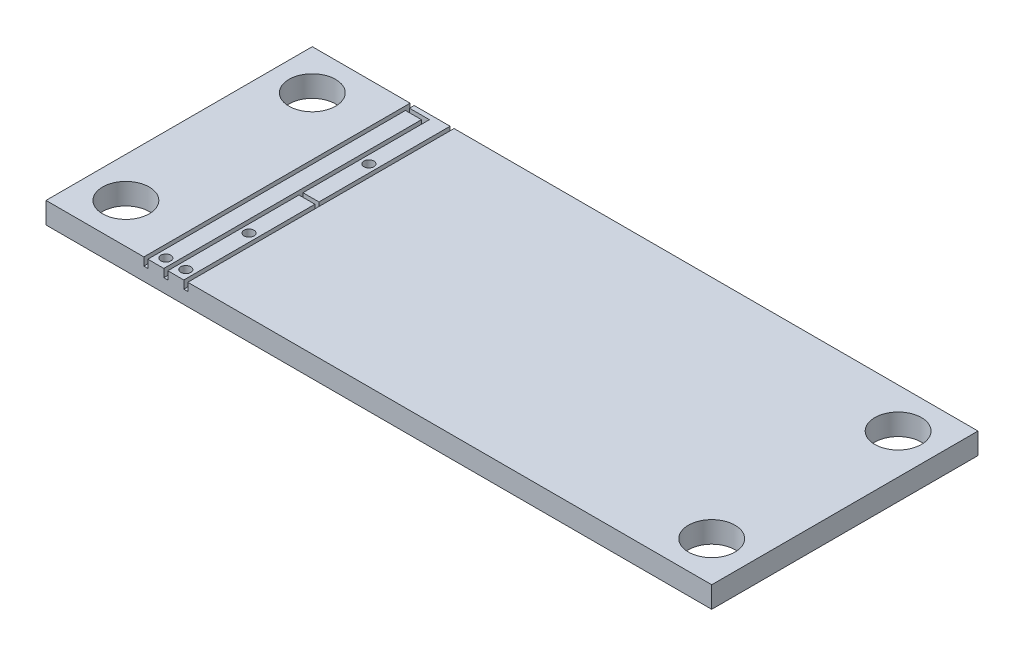
ISO-10303-21;
HEADER;
FILE_DESCRIPTION(('STEP AP214'),'2;1');
FILE_NAME('part.step','',(''),(''),'','','');
FILE_SCHEMA(('AUTOMOTIVE_DESIGN { 1 0 10303 214 1 1 1 1 }'));
ENDSEC;
DATA;
#1=APPLICATION_CONTEXT('core data for automotive mechanical design processes');
#2=APPLICATION_PROTOCOL_DEFINITION('international standard','automotive_design',2000,#1);
#3=PRODUCT_CONTEXT('',#1,'mechanical');
#4=PRODUCT('Part','Part','',(#3));
#5=PRODUCT_RELATED_PRODUCT_CATEGORY('part','',(#4));
#6=PRODUCT_DEFINITION_FORMATION('','',#4);
#7=PRODUCT_DEFINITION_CONTEXT('part definition',#1,'design');
#8=PRODUCT_DEFINITION('design','',#6,#7);
#9=PRODUCT_DEFINITION_SHAPE('','',#8);
#10=(LENGTH_UNIT() NAMED_UNIT(*) SI_UNIT(.MILLI.,.METRE.));
#11=(NAMED_UNIT(*) PLANE_ANGLE_UNIT() SI_UNIT($,.RADIAN.));
#12=(NAMED_UNIT(*) SI_UNIT($,.STERADIAN.) SOLID_ANGLE_UNIT());
#13=UNCERTAINTY_MEASURE_WITH_UNIT(LENGTH_MEASURE(1.E-05),#10,'distance_accuracy_value','');
#14=(GEOMETRIC_REPRESENTATION_CONTEXT(3) GLOBAL_UNCERTAINTY_ASSIGNED_CONTEXT((#13)) GLOBAL_UNIT_ASSIGNED_CONTEXT((#10,
#11,#12)) REPRESENTATION_CONTEXT('',''));
#15=CARTESIAN_POINT('',(0.,0.,0.));
#16=DIRECTION('',(0.,0.,1.));
#17=DIRECTION('',(1.,0.,0.));
#18=AXIS2_PLACEMENT_3D('',#15,#16,#17);
#19=CARTESIAN_POINT('',(0.,1.6,0.));
#20=DIRECTION('',(0.,-1.,0.));
#21=DIRECTION('',(0.,0.,-1.));
#22=AXIS2_PLACEMENT_3D('',#19,#20,#21);
#23=PLANE('',#22);
#24=CARTESIAN_POINT('',(47.,1.6,-3.));
#25=DIRECTION('',(0.,1.,0.));
#26=DIRECTION('',(0.,0.,1.));
#27=AXIS2_PLACEMENT_3D('',#24,#25,#26);
#28=CIRCLE('',#27,1.75);
#29=CARTESIAN_POINT('',(47.,1.6,-1.25));
#30=VERTEX_POINT('',#29);
#31=EDGE_CURVE('E507',#30,#30,#28,.T.);
#32=ORIENTED_EDGE('',*,*,#31,.F.);
#33=EDGE_LOOP('',(#32));
#34=FACE_BOUND('',#33,.T.);
#35=CARTESIAN_POINT('',(47.,1.6,-17.));
#36=DIRECTION('',(0.,1.,0.));
#37=DIRECTION('',(0.,0.,1.));
#38=AXIS2_PLACEMENT_3D('',#35,#36,#37);
#39=CIRCLE('',#38,1.75);
#40=CARTESIAN_POINT('',(47.,1.6,-15.25));
#41=VERTEX_POINT('',#40);
#42=EDGE_CURVE('E491',#41,#41,#39,.T.);
#43=ORIENTED_EDGE('',*,*,#42,.F.);
#44=EDGE_LOOP('',(#43));
#45=FACE_BOUND('',#44,.T.);
#46=DIRECTION('',(0.,0.,1.));
#47=VECTOR('',#46,1.);
#48=CARTESIAN_POINT('',(10.65,1.6,-20.));
#49=LINE('',#48,#47);
#50=CARTESIAN_POINT('',(10.65,1.6,-20.));
#51=VERTEX_POINT('',#50);
#52=CARTESIAN_POINT('',(10.65,1.6,0.));
#53=VERTEX_POINT('',#52);
#54=EDGE_CURVE('E405',#51,#53,#49,.T.);
#55=ORIENTED_EDGE('',*,*,#54,.T.);
#56=DIRECTION('',(1.,0.,0.));
#57=VECTOR('',#56,1.);
#58=CARTESIAN_POINT('',(0.,1.6,0.));
#59=LINE('',#58,#57);
#60=CARTESIAN_POINT('',(50.,1.6,0.));
#61=VERTEX_POINT('',#60);
#62=EDGE_CURVE('E526',#53,#61,#59,.T.);
#63=ORIENTED_EDGE('',*,*,#62,.T.);
#64=DIRECTION('',(0.,0.,-1.));
#65=VECTOR('',#64,1.);
#66=CARTESIAN_POINT('',(50.,1.6,0.));
#67=LINE('',#66,#65);
#68=CARTESIAN_POINT('',(50.,1.6,-20.));
#69=VERTEX_POINT('',#68);
#70=EDGE_CURVE('E529',#61,#69,#67,.T.);
#71=ORIENTED_EDGE('',*,*,#70,.T.);
#72=DIRECTION('',(-1.,0.,0.));
#73=VECTOR('',#72,1.);
#74=CARTESIAN_POINT('',(0.,1.6,-20.));
#75=LINE('',#74,#73);
#76=EDGE_CURVE('E533',#69,#51,#75,.T.);
#77=ORIENTED_EDGE('',*,*,#76,.T.);
#78=EDGE_LOOP('',(#55,#63,#71,#77));
#79=FACE_BOUND('',#78,.T.);
#80=ADVANCED_FACE('F127',(#34,#45,#79),#23,.F.);
#81=CARTESIAN_POINT('',(3.,1.6,-3.));
#82=DIRECTION('',(0.,1.,0.));
#83=DIRECTION('',(0.,0.,1.));
#84=AXIS2_PLACEMENT_3D('',#81,#82,#83);
#85=CIRCLE('',#84,1.75);
#86=CARTESIAN_POINT('',(3.,1.6,-1.25));
#87=VERTEX_POINT('',#86);
#88=EDGE_CURVE('E499',#87,#87,#85,.T.);
#89=ORIENTED_EDGE('',*,*,#88,.F.);
#90=EDGE_LOOP('',(#89));
#91=FACE_BOUND('',#90,.T.);
#92=CARTESIAN_POINT('',(3.,1.6,-17.));
#93=DIRECTION('',(0.,1.,0.));
#94=DIRECTION('',(0.,0.,1.));
#95=AXIS2_PLACEMENT_3D('',#92,#93,#94);
#96=CIRCLE('',#95,1.75);
#97=CARTESIAN_POINT('',(3.,1.6,-15.25));
#98=VERTEX_POINT('',#97);
#99=EDGE_CURVE('E515',#98,#98,#96,.T.);
#100=ORIENTED_EDGE('',*,*,#99,.F.);
#101=EDGE_LOOP('',(#100));
#102=FACE_BOUND('',#101,.T.);
#103=CARTESIAN_POINT('',(0.,1.6,0.));
#104=VERTEX_POINT('',#103);
#105=CARTESIAN_POINT('',(7.35,1.6,0.));
#106=VERTEX_POINT('',#105);
#107=EDGE_CURVE('E181',#104,#106,#59,.T.);
#108=ORIENTED_EDGE('',*,*,#107,.T.);
#109=DIRECTION('',(0.,0.,1.));
#110=VECTOR('',#109,1.);
#111=CARTESIAN_POINT('',(7.35,1.6,-20.));
#112=LINE('',#111,#110);
#113=CARTESIAN_POINT('',(7.35,1.6,-20.));
#114=VERTEX_POINT('',#113);
#115=EDGE_CURVE('E317',#114,#106,#112,.T.);
#116=ORIENTED_EDGE('',*,*,#115,.F.);
#117=CARTESIAN_POINT('',(0.,1.6,-20.));
#118=VERTEX_POINT('',#117);
#119=EDGE_CURVE('E152',#114,#118,#75,.T.);
#120=ORIENTED_EDGE('',*,*,#119,.T.);
#121=DIRECTION('',(0.,0.,1.));
#122=VECTOR('',#121,1.);
#123=CARTESIAN_POINT('',(0.,1.6,0.));
#124=LINE('',#123,#122);
#125=EDGE_CURVE('E523',#118,#104,#124,.T.);
#126=ORIENTED_EDGE('',*,*,#125,.T.);
#127=EDGE_LOOP('',(#108,#116,#120,#126));
#128=FACE_BOUND('',#127,.T.);
#129=ADVANCED_FACE('F653',(#91,#102,#128),#23,.F.);
#130=CARTESIAN_POINT('',(8.25,1.6,-0.75));
#131=DIRECTION('',(0.,1.,0.));
#132=DIRECTION('',(0.,0.,1.));
#133=AXIS2_PLACEMENT_3D('',#130,#131,#132);
#134=CIRCLE('',#133,0.375000000000001);
#135=CARTESIAN_POINT('',(8.25,1.6,-0.374999999999999));
#136=VERTEX_POINT('',#135);
#137=EDGE_CURVE('E464',#136,#136,#134,.T.);
#138=ORIENTED_EDGE('',*,*,#137,.F.);
#139=EDGE_LOOP('',(#138));
#140=FACE_BOUND('',#139,.T.);
#141=DIRECTION('',(0.,0.,1.));
#142=VECTOR('',#141,1.);
#143=CARTESIAN_POINT('',(7.65,1.6,-20.));
#144=LINE('',#143,#142);
#145=CARTESIAN_POINT('',(7.65,1.6,-19.35));
#146=VERTEX_POINT('',#145);
#147=CARTESIAN_POINT('',(7.65,1.6,0.));
#148=VERTEX_POINT('',#147);
#149=EDGE_CURVE('E330',#146,#148,#144,.T.);
#150=ORIENTED_EDGE('',*,*,#149,.T.);
#151=CARTESIAN_POINT('',(8.85,1.6,0.));
#152=VERTEX_POINT('',#151);
#153=EDGE_CURVE('E530',#148,#152,#59,.T.);
#154=ORIENTED_EDGE('',*,*,#153,.T.);
#155=DIRECTION('',(0.,0.,-1.));
#156=VECTOR('',#155,1.);
#157=CARTESIAN_POINT('',(8.85,1.6,0.));
#158=LINE('',#157,#156);
#159=CARTESIAN_POINT('',(8.85,1.6,-19.35));
#160=VERTEX_POINT('',#159);
#161=EDGE_CURVE('E344',#152,#160,#158,.T.);
#162=ORIENTED_EDGE('',*,*,#161,.T.);
#163=DIRECTION('',(-1.,0.,0.));
#164=VECTOR('',#163,1.);
#165=CARTESIAN_POINT('',(8.85,1.6,-19.35));
#166=LINE('',#165,#164);
#167=EDGE_CURVE('E368',#160,#146,#166,.T.);
#168=ORIENTED_EDGE('',*,*,#167,.T.);
#169=EDGE_LOOP('',(#150,#154,#162,#168));
#170=FACE_BOUND('',#169,.T.);
#171=ADVANCED_FACE('F604',(#140,#170),#23,.F.);
#172=CARTESIAN_POINT('',(9.75,1.6,-14.5));
#173=DIRECTION('',(0.,1.,0.));
#174=DIRECTION('',(0.,0.,1.));
#175=AXIS2_PLACEMENT_3D('',#172,#173,#174);
#176=CIRCLE('',#175,0.375000000000001);
#177=CARTESIAN_POINT('',(9.75,1.6,-14.125));
#178=VERTEX_POINT('',#177);
#179=EDGE_CURVE('E484',#178,#178,#176,.T.);
#180=ORIENTED_EDGE('',*,*,#179,.F.);
#181=EDGE_LOOP('',(#180));
#182=FACE_BOUND('',#181,.T.);
#183=CARTESIAN_POINT('',(7.65,1.6,-20.));
#184=VERTEX_POINT('',#183);
#185=CARTESIAN_POINT('',(7.65,1.6,-19.65));
#186=VERTEX_POINT('',#185);
#187=EDGE_CURVE('E306',#184,#186,#144,.T.);
#188=ORIENTED_EDGE('',*,*,#187,.T.);
#189=DIRECTION('',(-1.,0.,0.));
#190=VECTOR('',#189,1.);
#191=CARTESIAN_POINT('',(9.15,1.6,-19.65));
#192=LINE('',#191,#190);
#193=CARTESIAN_POINT('',(9.15,1.6,-19.65));
#194=VERTEX_POINT('',#193);
#195=EDGE_CURVE('E363',#194,#186,#192,.T.);
#196=ORIENTED_EDGE('',*,*,#195,.F.);
#197=DIRECTION('',(0.,0.,-1.));
#198=VECTOR('',#197,1.);
#199=CARTESIAN_POINT('',(9.15,1.6,0.));
#200=LINE('',#199,#198);
#201=CARTESIAN_POINT('',(9.15,1.6,-10.15));
#202=VERTEX_POINT('',#201);
#203=EDGE_CURVE('E364',#202,#194,#200,.T.);
#204=ORIENTED_EDGE('',*,*,#203,.F.);
#205=DIRECTION('',(-1.,0.,0.));
#206=VECTOR('',#205,1.);
#207=CARTESIAN_POINT('',(10.5,1.6,-10.15));
#208=LINE('',#207,#206);
#209=CARTESIAN_POINT('',(10.35,1.6,-10.15));
#210=VERTEX_POINT('',#209);
#211=EDGE_CURVE('E432',#210,#202,#208,.T.);
#212=ORIENTED_EDGE('',*,*,#211,.F.);
#213=DIRECTION('',(0.,0.,1.));
#214=VECTOR('',#213,1.);
#215=CARTESIAN_POINT('',(10.35,1.6,-20.));
#216=LINE('',#215,#214);
#217=CARTESIAN_POINT('',(10.35,1.6,-20.));
#218=VERTEX_POINT('',#217);
#219=EDGE_CURVE('E394',#218,#210,#216,.T.);
#220=ORIENTED_EDGE('',*,*,#219,.F.);
#221=EDGE_CURVE('E538',#218,#184,#75,.T.);
#222=ORIENTED_EDGE('',*,*,#221,.T.);
#223=EDGE_LOOP('',(#188,#196,#204,#212,#220,#222));
#224=FACE_BOUND('',#223,.T.);
#225=ADVANCED_FACE('F574',(#182,#224),#23,.F.);
#226=CARTESIAN_POINT('',(0.,1.6,0.));
#227=DIRECTION('',(0.,0.,-1.));
#228=DIRECTION('',(-1.,0.,0.));
#229=AXIS2_PLACEMENT_3D('',#226,#227,#228);
#230=PLANE('',#229);
#231=DIRECTION('',(0.,1.,0.));
#232=VECTOR('',#231,1.);
#233=CARTESIAN_POINT('',(7.65,1.,0.));
#234=LINE('',#233,#232);
#235=CARTESIAN_POINT('',(7.65,1.,0.));
#236=VERTEX_POINT('',#235);
#237=EDGE_CURVE('E311',#236,#148,#234,.T.);
#238=ORIENTED_EDGE('',*,*,#237,.F.);
#239=DIRECTION('',(1.,0.,0.));
#240=VECTOR('',#239,1.);
#241=CARTESIAN_POINT('',(7.35,1.,0.));
#242=LINE('',#241,#240);
#243=CARTESIAN_POINT('',(7.35,1.,0.));
#244=VERTEX_POINT('',#243);
#245=EDGE_CURVE('E299',#244,#236,#242,.T.);
#246=ORIENTED_EDGE('',*,*,#245,.F.);
#247=DIRECTION('',(0.,1.,0.));
#248=VECTOR('',#247,1.);
#249=CARTESIAN_POINT('',(7.35,1.,0.));
#250=LINE('',#249,#248);
#251=EDGE_CURVE('E334',#244,#106,#250,.T.);
#252=ORIENTED_EDGE('',*,*,#251,.T.);
#253=ORIENTED_EDGE('',*,*,#107,.F.);
#254=DIRECTION('',(0.,-1.,0.));
#255=VECTOR('',#254,1.);
#256=CARTESIAN_POINT('',(0.,1.6,0.));
#257=LINE('',#256,#255);
#258=CARTESIAN_POINT('',(0.,0.,0.));
#259=VERTEX_POINT('',#258);
#260=EDGE_CURVE('E12',#104,#259,#257,.T.);
#261=ORIENTED_EDGE('',*,*,#260,.T.);
#262=DIRECTION('',(1.,0.,0.));
#263=VECTOR('',#262,1.);
#264=CARTESIAN_POINT('',(0.,0.,0.));
#265=LINE('',#264,#263);
#266=CARTESIAN_POINT('',(50.,0.,0.));
#267=VERTEX_POINT('',#266);
#268=EDGE_CURVE('E542',#259,#267,#265,.T.);
#269=ORIENTED_EDGE('',*,*,#268,.T.);
#270=DIRECTION('',(0.,-1.,0.));
#271=VECTOR('',#270,1.);
#272=CARTESIAN_POINT('',(50.,1.6,0.));
#273=LINE('',#272,#271);
#274=EDGE_CURVE('E136',#61,#267,#273,.T.);
#275=ORIENTED_EDGE('',*,*,#274,.F.);
#276=ORIENTED_EDGE('',*,*,#62,.F.);
#277=DIRECTION('',(0.,1.,0.));
#278=VECTOR('',#277,1.);
#279=CARTESIAN_POINT('',(10.65,1.,0.));
#280=LINE('',#279,#278);
#281=CARTESIAN_POINT('',(10.65,1.,0.));
#282=VERTEX_POINT('',#281);
#283=EDGE_CURVE('E420',#282,#53,#280,.T.);
#284=ORIENTED_EDGE('',*,*,#283,.F.);
#285=DIRECTION('',(1.,0.,0.));
#286=VECTOR('',#285,1.);
#287=CARTESIAN_POINT('',(10.35,1.,0.));
#288=LINE('',#287,#286);
#289=CARTESIAN_POINT('',(10.35,1.,0.));
#290=VERTEX_POINT('',#289);
#291=EDGE_CURVE('E397',#290,#282,#288,.T.);
#292=ORIENTED_EDGE('',*,*,#291,.F.);
#293=DIRECTION('',(0.,1.,0.));
#294=VECTOR('',#293,1.);
#295=CARTESIAN_POINT('',(10.35,1.,0.));
#296=LINE('',#295,#294);
#297=CARTESIAN_POINT('',(10.35,1.6,0.));
#298=VERTEX_POINT('',#297);
#299=EDGE_CURVE('E416',#290,#298,#296,.T.);
#300=ORIENTED_EDGE('',*,*,#299,.T.);
#301=CARTESIAN_POINT('',(9.15,1.6,0.));
#302=VERTEX_POINT('',#301);
#303=EDGE_CURVE('E592',#302,#298,#59,.T.);
#304=ORIENTED_EDGE('',*,*,#303,.F.);
#305=DIRECTION('',(0.,1.,0.));
#306=VECTOR('',#305,1.);
#307=CARTESIAN_POINT('',(9.15,1.,0.));
#308=LINE('',#307,#306);
#309=CARTESIAN_POINT('',(9.15,1.,0.));
#310=VERTEX_POINT('',#309);
#311=EDGE_CURVE('E358',#310,#302,#308,.T.);
#312=ORIENTED_EDGE('',*,*,#311,.F.);
#313=DIRECTION('',(1.,0.,0.));
#314=VECTOR('',#313,1.);
#315=CARTESIAN_POINT('',(8.85,1.,0.));
#316=LINE('',#315,#314);
#317=CARTESIAN_POINT('',(8.85,1.,0.));
#318=VERTEX_POINT('',#317);
#319=EDGE_CURVE('E339',#318,#310,#316,.T.);
#320=ORIENTED_EDGE('',*,*,#319,.F.);
#321=DIRECTION('',(0.,1.,0.));
#322=VECTOR('',#321,1.);
#323=CARTESIAN_POINT('',(8.85,1.,0.));
#324=LINE('',#323,#322);
#325=EDGE_CURVE('E375',#318,#152,#324,.T.);
#326=ORIENTED_EDGE('',*,*,#325,.T.);
#327=ORIENTED_EDGE('',*,*,#153,.F.);
#328=EDGE_LOOP('',(#238,#246,#252,#253,#261,#269,#275,#276,#284,#292,#300,#304,#312,#320,#326,#327));
#329=FACE_BOUND('',#328,.T.);
#330=ADVANCED_FACE('F607',(#329),#230,.F.);
#331=CARTESIAN_POINT('',(0.,1.6,-20.));
#332=DIRECTION('',(0.,0.,1.));
#333=DIRECTION('',(1.,0.,0.));
#334=AXIS2_PLACEMENT_3D('',#331,#332,#333);
#335=PLANE('',#334);
#336=ORIENTED_EDGE('',*,*,#119,.F.);
#337=DIRECTION('',(0.,1.,0.));
#338=VECTOR('',#337,1.);
#339=CARTESIAN_POINT('',(7.35,1.,-20.));
#340=LINE('',#339,#338);
#341=CARTESIAN_POINT('',(7.35,1.,-20.));
#342=VERTEX_POINT('',#341);
#343=EDGE_CURVE('E315',#342,#114,#340,.T.);
#344=ORIENTED_EDGE('',*,*,#343,.F.);
#345=DIRECTION('',(1.,0.,0.));
#346=VECTOR('',#345,1.);
#347=CARTESIAN_POINT('',(7.35,1.,-20.));
#348=LINE('',#347,#346);
#349=CARTESIAN_POINT('',(7.65,1.,-20.));
#350=VERTEX_POINT('',#349);
#351=EDGE_CURVE('E293',#342,#350,#348,.T.);
#352=ORIENTED_EDGE('',*,*,#351,.T.);
#353=DIRECTION('',(0.,1.,0.));
#354=VECTOR('',#353,1.);
#355=CARTESIAN_POINT('',(7.65,1.,-20.));
#356=LINE('',#355,#354);
#357=EDGE_CURVE('E303',#350,#184,#356,.T.);
#358=ORIENTED_EDGE('',*,*,#357,.T.);
#359=ORIENTED_EDGE('',*,*,#221,.F.);
#360=DIRECTION('',(0.,1.,0.));
#361=VECTOR('',#360,1.);
#362=CARTESIAN_POINT('',(10.35,1.,-20.));
#363=LINE('',#362,#361);
#364=CARTESIAN_POINT('',(10.35,1.,-20.));
#365=VERTEX_POINT('',#364);
#366=EDGE_CURVE('E404',#365,#218,#363,.T.);
#367=ORIENTED_EDGE('',*,*,#366,.F.);
#368=DIRECTION('',(1.,0.,0.));
#369=VECTOR('',#368,1.);
#370=CARTESIAN_POINT('',(10.35,1.,-20.));
#371=LINE('',#370,#369);
#372=CARTESIAN_POINT('',(10.65,1.,-20.));
#373=VERTEX_POINT('',#372);
#374=EDGE_CURVE('E389',#365,#373,#371,.T.);
#375=ORIENTED_EDGE('',*,*,#374,.T.);
#376=DIRECTION('',(0.,1.,0.));
#377=VECTOR('',#376,1.);
#378=CARTESIAN_POINT('',(10.65,1.,-20.));
#379=LINE('',#378,#377);
#380=EDGE_CURVE('E423',#373,#51,#379,.T.);
#381=ORIENTED_EDGE('',*,*,#380,.T.);
#382=ORIENTED_EDGE('',*,*,#76,.F.);
#383=DIRECTION('',(0.,-1.,0.));
#384=VECTOR('',#383,1.);
#385=CARTESIAN_POINT('',(50.,1.6,-20.));
#386=LINE('',#385,#384);
#387=CARTESIAN_POINT('',(50.,0.,-20.));
#388=VERTEX_POINT('',#387);
#389=EDGE_CURVE('E552',#69,#388,#386,.T.);
#390=ORIENTED_EDGE('',*,*,#389,.T.);
#391=DIRECTION('',(-1.,0.,0.));
#392=VECTOR('',#391,1.);
#393=CARTESIAN_POINT('',(0.,0.,-20.));
#394=LINE('',#393,#392);
#395=CARTESIAN_POINT('',(0.,0.,-20.));
#396=VERTEX_POINT('',#395);
#397=EDGE_CURVE('E174',#388,#396,#394,.T.);
#398=ORIENTED_EDGE('',*,*,#397,.T.);
#399=DIRECTION('',(0.,-1.,0.));
#400=VECTOR('',#399,1.);
#401=CARTESIAN_POINT('',(0.,1.6,-20.));
#402=LINE('',#401,#400);
#403=EDGE_CURVE('E537',#118,#396,#402,.T.);
#404=ORIENTED_EDGE('',*,*,#403,.F.);
#405=EDGE_LOOP('',(#336,#344,#352,#358,#359,#367,#375,#381,#382,#390,#398,#404));
#406=FACE_BOUND('',#405,.T.);
#407=ADVANCED_FACE('F314',(#406),#335,.F.);
#408=ORIENTED_EDGE('',*,*,#303,.T.);
#409=CARTESIAN_POINT('',(10.35,1.6,-9.85));
#410=VERTEX_POINT('',#409);
#411=EDGE_CURVE('E409',#410,#298,#216,.T.);
#412=ORIENTED_EDGE('',*,*,#411,.F.);
#413=DIRECTION('',(-1.,0.,0.));
#414=VECTOR('',#413,1.);
#415=CARTESIAN_POINT('',(10.5,1.6,-9.85));
#416=LINE('',#415,#414);
#417=CARTESIAN_POINT('',(9.15,1.6,-9.85));
#418=VERTEX_POINT('',#417);
#419=EDGE_CURVE('E436',#410,#418,#416,.T.);
#420=ORIENTED_EDGE('',*,*,#419,.T.);
#421=EDGE_CURVE('E359',#302,#418,#200,.T.);
#422=ORIENTED_EDGE('',*,*,#421,.F.);
#423=EDGE_LOOP('',(#408,#412,#420,#422));
#424=FACE_BOUND('',#423,.T.);
#425=CARTESIAN_POINT('',(9.75,1.6,-5.5));
#426=DIRECTION('',(0.,1.,0.));
#427=DIRECTION('',(0.,0.,1.));
#428=AXIS2_PLACEMENT_3D('',#425,#426,#427);
#429=CIRCLE('',#428,0.375000000000001);
#430=CARTESIAN_POINT('',(9.75,1.6,-5.125));
#431=VERTEX_POINT('',#430);
#432=EDGE_CURVE('E469',#431,#431,#429,.T.);
#433=ORIENTED_EDGE('',*,*,#432,.F.);
#434=EDGE_LOOP('',(#433));
#435=FACE_BOUND('',#434,.T.);
#436=CARTESIAN_POINT('',(9.75,1.6,-0.75));
#437=DIRECTION('',(0.,1.,0.));
#438=DIRECTION('',(0.,0.,1.));
#439=AXIS2_PLACEMENT_3D('',#436,#437,#438);
#440=CIRCLE('',#439,0.375000000000001);
#441=CARTESIAN_POINT('',(9.75,1.6,-0.374999999999999));
#442=VERTEX_POINT('',#441);
#443=EDGE_CURVE('E468',#442,#442,#440,.T.);
#444=ORIENTED_EDGE('',*,*,#443,.F.);
#445=EDGE_LOOP('',(#444));
#446=FACE_BOUND('',#445,.T.);
#447=ADVANCED_FACE('F634',(#424,#435,#446),#23,.F.);
#448=CARTESIAN_POINT('',(0.,0.,0.));
#449=DIRECTION('',(0.,-1.,0.));
#450=DIRECTION('',(0.,0.,-1.));
#451=AXIS2_PLACEMENT_3D('',#448,#449,#450);
#452=PLANE('',#451);
#453=CARTESIAN_POINT('',(8.25,0.,-0.75));
#454=DIRECTION('',(0.,1.,0.));
#455=DIRECTION('',(0.,0.,1.));
#456=AXIS2_PLACEMENT_3D('',#453,#454,#455);
#457=CIRCLE('',#456,0.375000000000001);
#458=CARTESIAN_POINT('',(8.25,0.,-0.374999999999999));
#459=VERTEX_POINT('',#458);
#460=EDGE_CURVE('E459',#459,#459,#457,.T.);
#461=ORIENTED_EDGE('',*,*,#460,.T.);
#462=EDGE_LOOP('',(#461));
#463=FACE_BOUND('',#462,.T.);
#464=CARTESIAN_POINT('',(9.75,0.,-5.5));
#465=DIRECTION('',(0.,1.,0.));
#466=DIRECTION('',(0.,0.,1.));
#467=AXIS2_PLACEMENT_3D('',#464,#465,#466);
#468=CIRCLE('',#467,0.375000000000001);
#469=CARTESIAN_POINT('',(9.75,0.,-5.125));
#470=VERTEX_POINT('',#469);
#471=EDGE_CURVE('E458',#470,#470,#468,.T.);
#472=ORIENTED_EDGE('',*,*,#471,.T.);
#473=EDGE_LOOP('',(#472));
#474=FACE_BOUND('',#473,.T.);
#475=CARTESIAN_POINT('',(9.75,0.,-14.5));
#476=DIRECTION('',(0.,1.,0.));
#477=DIRECTION('',(0.,0.,1.));
#478=AXIS2_PLACEMENT_3D('',#475,#476,#477);
#479=CIRCLE('',#478,0.375000000000001);
#480=CARTESIAN_POINT('',(9.75,0.,-14.125));
#481=VERTEX_POINT('',#480);
#482=EDGE_CURVE('E473',#481,#481,#479,.T.);
#483=ORIENTED_EDGE('',*,*,#482,.T.);
#484=EDGE_LOOP('',(#483));
#485=FACE_BOUND('',#484,.T.);
#486=CARTESIAN_POINT('',(9.75,0.,-0.75));
#487=DIRECTION('',(0.,1.,0.));
#488=DIRECTION('',(0.,0.,1.));
#489=AXIS2_PLACEMENT_3D('',#486,#487,#488);
#490=CIRCLE('',#489,0.375000000000001);
#491=CARTESIAN_POINT('',(9.75,0.,-0.374999999999999));
#492=VERTEX_POINT('',#491);
#493=EDGE_CURVE('E480',#492,#492,#490,.T.);
#494=ORIENTED_EDGE('',*,*,#493,.T.);
#495=EDGE_LOOP('',(#494));
#496=FACE_BOUND('',#495,.T.);
#497=CARTESIAN_POINT('',(3.,0.,-3.));
#498=DIRECTION('',(0.,1.,0.));
#499=DIRECTION('',(0.,0.,1.));
#500=AXIS2_PLACEMENT_3D('',#497,#498,#499);
#501=CIRCLE('',#500,1.75);
#502=CARTESIAN_POINT('',(3.,0.,-1.25));
#503=VERTEX_POINT('',#502);
#504=EDGE_CURVE('E495',#503,#503,#501,.T.);
#505=ORIENTED_EDGE('',*,*,#504,.T.);
#506=EDGE_LOOP('',(#505));
#507=FACE_BOUND('',#506,.T.);
#508=CARTESIAN_POINT('',(3.,0.,-17.));
#509=DIRECTION('',(0.,1.,0.));
#510=DIRECTION('',(0.,0.,1.));
#511=AXIS2_PLACEMENT_3D('',#508,#509,#510);
#512=CIRCLE('',#511,1.75);
#513=CARTESIAN_POINT('',(3.,0.,-15.25));
#514=VERTEX_POINT('',#513);
#515=EDGE_CURVE('E511',#514,#514,#512,.T.);
#516=ORIENTED_EDGE('',*,*,#515,.T.);
#517=EDGE_LOOP('',(#516));
#518=FACE_BOUND('',#517,.T.);
#519=DIRECTION('',(0.,0.,1.));
#520=VECTOR('',#519,1.);
#521=CARTESIAN_POINT('',(0.,0.,0.));
#522=LINE('',#521,#520);
#523=EDGE_CURVE('E519',#396,#259,#522,.T.);
#524=ORIENTED_EDGE('',*,*,#523,.F.);
#525=ORIENTED_EDGE('',*,*,#397,.F.);
#526=DIRECTION('',(0.,0.,-1.));
#527=VECTOR('',#526,1.);
#528=CARTESIAN_POINT('',(50.,0.,0.));
#529=LINE('',#528,#527);
#530=EDGE_CURVE('E545',#267,#388,#529,.T.);
#531=ORIENTED_EDGE('',*,*,#530,.F.);
#532=ORIENTED_EDGE('',*,*,#268,.F.);
#533=EDGE_LOOP('',(#524,#525,#531,#532));
#534=FACE_BOUND('',#533,.T.);
#535=CARTESIAN_POINT('',(47.,0.,-3.));
#536=DIRECTION('',(0.,1.,0.));
#537=DIRECTION('',(0.,0.,1.));
#538=AXIS2_PLACEMENT_3D('',#535,#536,#537);
#539=CIRCLE('',#538,1.75);
#540=CARTESIAN_POINT('',(47.,0.,-1.25));
#541=VERTEX_POINT('',#540);
#542=EDGE_CURVE('E503',#541,#541,#539,.T.);
#543=ORIENTED_EDGE('',*,*,#542,.T.);
#544=EDGE_LOOP('',(#543));
#545=FACE_BOUND('',#544,.T.);
#546=CARTESIAN_POINT('',(47.,0.,-17.));
#547=DIRECTION('',(0.,1.,0.));
#548=DIRECTION('',(0.,0.,1.));
#549=AXIS2_PLACEMENT_3D('',#546,#547,#548);
#550=CIRCLE('',#549,1.75);
#551=CARTESIAN_POINT('',(47.,0.,-15.25));
#552=VERTEX_POINT('',#551);
#553=EDGE_CURVE('E463',#552,#552,#550,.T.);
#554=ORIENTED_EDGE('',*,*,#553,.T.);
#555=EDGE_LOOP('',(#554));
#556=FACE_BOUND('',#555,.T.);
#557=ADVANCED_FACE('F565',(#463,#474,#485,#496,#507,#518,#534,#545,#556),#452,.T.);
#558=CARTESIAN_POINT('',(0.,1.6,0.));
#559=DIRECTION('',(1.,0.,0.));
#560=DIRECTION('',(0.,0.,-1.));
#561=AXIS2_PLACEMENT_3D('',#558,#559,#560);
#562=PLANE('',#561);
#563=ORIENTED_EDGE('',*,*,#523,.T.);
#564=ORIENTED_EDGE('',*,*,#260,.F.);
#565=ORIENTED_EDGE('',*,*,#125,.F.);
#566=ORIENTED_EDGE('',*,*,#403,.T.);
#567=EDGE_LOOP('',(#563,#564,#565,#566));
#568=FACE_BOUND('',#567,.T.);
#569=ADVANCED_FACE('F129',(#568),#562,.F.);
#570=CARTESIAN_POINT('',(50.,1.6,0.));
#571=DIRECTION('',(-1.,0.,0.));
#572=DIRECTION('',(0.,0.,1.));
#573=AXIS2_PLACEMENT_3D('',#570,#571,#572);
#574=PLANE('',#573);
#575=ORIENTED_EDGE('',*,*,#530,.T.);
#576=ORIENTED_EDGE('',*,*,#389,.F.);
#577=ORIENTED_EDGE('',*,*,#70,.F.);
#578=ORIENTED_EDGE('',*,*,#274,.T.);
#579=EDGE_LOOP('',(#575,#576,#577,#578));
#580=FACE_BOUND('',#579,.T.);
#581=ADVANCED_FACE('F560',(#580),#574,.F.);
#582=CARTESIAN_POINT('',(3.,1.6,-17.));
#583=DIRECTION('',(0.,-1.,0.));
#584=DIRECTION('',(0.,0.,-1.));
#585=AXIS2_PLACEMENT_3D('',#582,#583,#584);
#586=CYLINDRICAL_SURFACE('',#585,1.75);
#587=ORIENTED_EDGE('',*,*,#99,.T.);
#588=EDGE_LOOP('',(#587));
#589=FACE_BOUND('',#588,.T.);
#590=ORIENTED_EDGE('',*,*,#515,.F.);
#591=EDGE_LOOP('',(#590));
#592=FACE_BOUND('',#591,.T.);
#593=ADVANCED_FACE('F707',(#589,#592),#586,.F.);
#594=CARTESIAN_POINT('',(47.,1.6,-3.));
#595=DIRECTION('',(0.,-1.,0.));
#596=DIRECTION('',(0.,0.,-1.));
#597=AXIS2_PLACEMENT_3D('',#594,#595,#596);
#598=CYLINDRICAL_SURFACE('',#597,1.75);
#599=ORIENTED_EDGE('',*,*,#31,.T.);
#600=EDGE_LOOP('',(#599));
#601=FACE_BOUND('',#600,.T.);
#602=ORIENTED_EDGE('',*,*,#542,.F.);
#603=EDGE_LOOP('',(#602));
#604=FACE_BOUND('',#603,.T.);
#605=ADVANCED_FACE('F704',(#601,#604),#598,.F.);
#606=CARTESIAN_POINT('',(3.,1.6,-3.));
#607=DIRECTION('',(0.,-1.,0.));
#608=DIRECTION('',(0.,0.,-1.));
#609=AXIS2_PLACEMENT_3D('',#606,#607,#608);
#610=CYLINDRICAL_SURFACE('',#609,1.75);
#611=ORIENTED_EDGE('',*,*,#88,.T.);
#612=EDGE_LOOP('',(#611));
#613=FACE_BOUND('',#612,.T.);
#614=ORIENTED_EDGE('',*,*,#504,.F.);
#615=EDGE_LOOP('',(#614));
#616=FACE_BOUND('',#615,.T.);
#617=ADVANCED_FACE('F700',(#613,#616),#610,.F.);
#618=CARTESIAN_POINT('',(47.,1.6,-17.));
#619=DIRECTION('',(0.,-1.,0.));
#620=DIRECTION('',(0.,0.,-1.));
#621=AXIS2_PLACEMENT_3D('',#618,#619,#620);
#622=CYLINDRICAL_SURFACE('',#621,1.75);
#623=ORIENTED_EDGE('',*,*,#42,.T.);
#624=EDGE_LOOP('',(#623));
#625=FACE_BOUND('',#624,.T.);
#626=ORIENTED_EDGE('',*,*,#553,.F.);
#627=EDGE_LOOP('',(#626));
#628=FACE_BOUND('',#627,.T.);
#629=ADVANCED_FACE('F693',(#625,#628),#622,.F.);
#630=CARTESIAN_POINT('',(9.75,0.,-0.75));
#631=DIRECTION('',(0.,1.,0.));
#632=DIRECTION('',(0.,0.,1.));
#633=AXIS2_PLACEMENT_3D('',#630,#631,#632);
#634=CYLINDRICAL_SURFACE('',#633,0.375000000000001);
#635=ORIENTED_EDGE('',*,*,#493,.F.);
#636=EDGE_LOOP('',(#635));
#637=FACE_BOUND('',#636,.T.);
#638=ORIENTED_EDGE('',*,*,#443,.T.);
#639=EDGE_LOOP('',(#638));
#640=FACE_BOUND('',#639,.T.);
#641=ADVANCED_FACE('F683',(#637,#640),#634,.F.);
#642=CARTESIAN_POINT('',(9.75,0.,-14.5));
#643=DIRECTION('',(0.,1.,0.));
#644=DIRECTION('',(0.,0.,1.));
#645=AXIS2_PLACEMENT_3D('',#642,#643,#644);
#646=CYLINDRICAL_SURFACE('',#645,0.375000000000001);
#647=ORIENTED_EDGE('',*,*,#482,.F.);
#648=EDGE_LOOP('',(#647));
#649=FACE_BOUND('',#648,.T.);
#650=ORIENTED_EDGE('',*,*,#179,.T.);
#651=EDGE_LOOP('',(#650));
#652=FACE_BOUND('',#651,.T.);
#653=ADVANCED_FACE('F680',(#649,#652),#646,.F.);
#654=CARTESIAN_POINT('',(9.75,0.,-5.5));
#655=DIRECTION('',(0.,1.,0.));
#656=DIRECTION('',(0.,0.,1.));
#657=AXIS2_PLACEMENT_3D('',#654,#655,#656);
#658=CYLINDRICAL_SURFACE('',#657,0.375000000000001);
#659=ORIENTED_EDGE('',*,*,#471,.F.);
#660=EDGE_LOOP('',(#659));
#661=FACE_BOUND('',#660,.T.);
#662=ORIENTED_EDGE('',*,*,#432,.T.);
#663=EDGE_LOOP('',(#662));
#664=FACE_BOUND('',#663,.T.);
#665=ADVANCED_FACE('F682',(#661,#664),#658,.F.);
#666=CARTESIAN_POINT('',(8.25,0.,-0.75));
#667=DIRECTION('',(0.,1.,0.));
#668=DIRECTION('',(0.,0.,1.));
#669=AXIS2_PLACEMENT_3D('',#666,#667,#668);
#670=CYLINDRICAL_SURFACE('',#669,0.375000000000001);
#671=ORIENTED_EDGE('',*,*,#460,.F.);
#672=EDGE_LOOP('',(#671));
#673=FACE_BOUND('',#672,.T.);
#674=ORIENTED_EDGE('',*,*,#137,.T.);
#675=EDGE_LOOP('',(#674));
#676=FACE_BOUND('',#675,.T.);
#677=ADVANCED_FACE('F690',(#673,#676),#670,.F.);
#678=CARTESIAN_POINT('',(7.65,1.,-20.));
#679=DIRECTION('',(-1.,0.,0.));
#680=DIRECTION('',(0.,0.,1.));
#681=AXIS2_PLACEMENT_3D('',#678,#679,#680);
#682=PLANE('',#681);
#683=DIRECTION('',(0.,-1.,0.));
#684=VECTOR('',#683,1.);
#685=CARTESIAN_POINT('',(7.65,1.,-19.35));
#686=LINE('',#685,#684);
#687=CARTESIAN_POINT('',(7.65,1.,-19.35));
#688=VERTEX_POINT('',#687);
#689=EDGE_CURVE('E455',#146,#688,#686,.T.);
#690=ORIENTED_EDGE('',*,*,#689,.T.);
#691=DIRECTION('',(0.,0.,1.));
#692=VECTOR('',#691,1.);
#693=CARTESIAN_POINT('',(7.65,1.,-20.));
#694=LINE('',#693,#692);
#695=EDGE_CURVE('E300',#688,#236,#694,.T.);
#696=ORIENTED_EDGE('',*,*,#695,.T.);
#697=ORIENTED_EDGE('',*,*,#237,.T.);
#698=ORIENTED_EDGE('',*,*,#149,.F.);
#699=EDGE_LOOP('',(#690,#696,#697,#698));
#700=FACE_BOUND('',#699,.T.);
#701=ADVANCED_FACE('F621',(#700),#682,.T.);
#702=CARTESIAN_POINT('',(7.35,1.,-20.));
#703=DIRECTION('',(-1.,0.,0.));
#704=DIRECTION('',(0.,0.,1.));
#705=AXIS2_PLACEMENT_3D('',#702,#703,#704);
#706=PLANE('',#705);
#707=ORIENTED_EDGE('',*,*,#115,.T.);
#708=ORIENTED_EDGE('',*,*,#251,.F.);
#709=DIRECTION('',(0.,0.,1.));
#710=VECTOR('',#709,1.);
#711=CARTESIAN_POINT('',(7.35,1.,-20.));
#712=LINE('',#711,#710);
#713=EDGE_CURVE('E326',#342,#244,#712,.T.);
#714=ORIENTED_EDGE('',*,*,#713,.F.);
#715=ORIENTED_EDGE('',*,*,#343,.T.);
#716=EDGE_LOOP('',(#707,#708,#714,#715));
#717=FACE_BOUND('',#716,.T.);
#718=ADVANCED_FACE('F721',(#717),#706,.F.);
#719=ORIENTED_EDGE('',*,*,#187,.F.);
#720=ORIENTED_EDGE('',*,*,#357,.F.);
#721=CARTESIAN_POINT('',(7.65,1.,-19.65));
#722=VERTEX_POINT('',#721);
#723=EDGE_CURVE('E288',#350,#722,#694,.T.);
#724=ORIENTED_EDGE('',*,*,#723,.T.);
#725=DIRECTION('',(0.,-1.,0.));
#726=VECTOR('',#725,1.);
#727=CARTESIAN_POINT('',(7.65,1.,-19.65));
#728=LINE('',#727,#726);
#729=EDGE_CURVE('E310',#186,#722,#728,.T.);
#730=ORIENTED_EDGE('',*,*,#729,.F.);
#731=EDGE_LOOP('',(#719,#720,#724,#730));
#732=FACE_BOUND('',#731,.T.);
#733=ADVANCED_FACE('F304',(#732),#682,.T.);
#734=CARTESIAN_POINT('',(0.,1.,0.));
#735=DIRECTION('',(0.,-1.,0.));
#736=DIRECTION('',(0.,0.,-1.));
#737=AXIS2_PLACEMENT_3D('',#734,#735,#736);
#738=PLANE('',#737);
#739=ORIENTED_EDGE('',*,*,#723,.F.);
#740=ORIENTED_EDGE('',*,*,#351,.F.);
#741=ORIENTED_EDGE('',*,*,#713,.T.);
#742=ORIENTED_EDGE('',*,*,#245,.T.);
#743=ORIENTED_EDGE('',*,*,#695,.F.);
#744=DIRECTION('',(-1.,0.,0.));
#745=VECTOR('',#744,1.);
#746=CARTESIAN_POINT('',(8.85,1.,-19.35));
#747=LINE('',#746,#745);
#748=CARTESIAN_POINT('',(8.85,1.,-19.35));
#749=VERTEX_POINT('',#748);
#750=EDGE_CURVE('E351',#749,#688,#747,.T.);
#751=ORIENTED_EDGE('',*,*,#750,.F.);
#752=DIRECTION('',(0.,0.,-1.));
#753=VECTOR('',#752,1.);
#754=CARTESIAN_POINT('',(8.85,1.,0.));
#755=LINE('',#754,#753);
#756=EDGE_CURVE('E355',#318,#749,#755,.T.);
#757=ORIENTED_EDGE('',*,*,#756,.F.);
#758=ORIENTED_EDGE('',*,*,#319,.T.);
#759=DIRECTION('',(0.,0.,-1.));
#760=VECTOR('',#759,1.);
#761=CARTESIAN_POINT('',(9.15,1.,0.));
#762=LINE('',#761,#760);
#763=CARTESIAN_POINT('',(9.15,1.,-9.85));
#764=VERTEX_POINT('',#763);
#765=EDGE_CURVE('E345',#310,#764,#762,.T.);
#766=ORIENTED_EDGE('',*,*,#765,.T.);
#767=DIRECTION('',(-1.,0.,0.));
#768=VECTOR('',#767,1.);
#769=CARTESIAN_POINT('',(10.5,1.,-9.85));
#770=LINE('',#769,#768);
#771=CARTESIAN_POINT('',(10.35,1.,-9.85));
#772=VERTEX_POINT('',#771);
#773=EDGE_CURVE('E428',#772,#764,#770,.T.);
#774=ORIENTED_EDGE('',*,*,#773,.F.);
#775=DIRECTION('',(0.,0.,1.));
#776=VECTOR('',#775,1.);
#777=CARTESIAN_POINT('',(10.35,1.,-20.));
#778=LINE('',#777,#776);
#779=EDGE_CURVE('E401',#772,#290,#778,.T.);
#780=ORIENTED_EDGE('',*,*,#779,.T.);
#781=ORIENTED_EDGE('',*,*,#291,.T.);
#782=DIRECTION('',(0.,0.,1.));
#783=VECTOR('',#782,1.);
#784=CARTESIAN_POINT('',(10.65,1.,-20.));
#785=LINE('',#784,#783);
#786=EDGE_CURVE('E393',#373,#282,#785,.T.);
#787=ORIENTED_EDGE('',*,*,#786,.F.);
#788=ORIENTED_EDGE('',*,*,#374,.F.);
#789=CARTESIAN_POINT('',(10.35,1.,-10.15));
#790=VERTEX_POINT('',#789);
#791=EDGE_CURVE('E143',#365,#790,#778,.T.);
#792=ORIENTED_EDGE('',*,*,#791,.T.);
#793=DIRECTION('',(-1.,0.,0.));
#794=VECTOR('',#793,1.);
#795=CARTESIAN_POINT('',(10.5,1.,-10.15));
#796=LINE('',#795,#794);
#797=CARTESIAN_POINT('',(9.15,1.,-10.15));
#798=VERTEX_POINT('',#797);
#799=EDGE_CURVE('E410',#790,#798,#796,.T.);
#800=ORIENTED_EDGE('',*,*,#799,.T.);
#801=CARTESIAN_POINT('',(9.15,1.,-19.65));
#802=VERTEX_POINT('',#801);
#803=EDGE_CURVE('E343',#798,#802,#762,.T.);
#804=ORIENTED_EDGE('',*,*,#803,.T.);
#805=DIRECTION('',(-1.,0.,0.));
#806=VECTOR('',#805,1.);
#807=CARTESIAN_POINT('',(9.15,1.,-19.65));
#808=LINE('',#807,#806);
#809=EDGE_CURVE('E296',#802,#722,#808,.T.);
#810=ORIENTED_EDGE('',*,*,#809,.T.);
#811=EDGE_LOOP('',(#739,#740,#741,#742,#743,#751,#757,#758,#766,#774,#780,#781,#787,#788,#792,
#800,#804,#810));
#812=FACE_BOUND('',#811,.T.);
#813=ADVANCED_FACE('F290',(#812),#738,.F.);
#814=CARTESIAN_POINT('',(10.65,1.,-20.));
#815=DIRECTION('',(-1.,0.,0.));
#816=DIRECTION('',(0.,0.,1.));
#817=AXIS2_PLACEMENT_3D('',#814,#815,#816);
#818=PLANE('',#817);
#819=ORIENTED_EDGE('',*,*,#54,.F.);
#820=ORIENTED_EDGE('',*,*,#380,.F.);
#821=ORIENTED_EDGE('',*,*,#786,.T.);
#822=ORIENTED_EDGE('',*,*,#283,.T.);
#823=EDGE_LOOP('',(#819,#820,#821,#822));
#824=FACE_BOUND('',#823,.T.);
#825=ADVANCED_FACE('F588',(#824),#818,.T.);
#826=CARTESIAN_POINT('',(10.35,1.,-20.));
#827=DIRECTION('',(-1.,0.,0.));
#828=DIRECTION('',(0.,0.,1.));
#829=AXIS2_PLACEMENT_3D('',#826,#827,#828);
#830=PLANE('',#829);
#831=DIRECTION('',(0.,-1.,0.));
#832=VECTOR('',#831,1.);
#833=CARTESIAN_POINT('',(10.35,1.,-10.15));
#834=LINE('',#833,#832);
#835=EDGE_CURVE('E427',#210,#790,#834,.T.);
#836=ORIENTED_EDGE('',*,*,#835,.T.);
#837=ORIENTED_EDGE('',*,*,#791,.F.);
#838=ORIENTED_EDGE('',*,*,#366,.T.);
#839=ORIENTED_EDGE('',*,*,#219,.T.);
#840=EDGE_LOOP('',(#836,#837,#838,#839));
#841=FACE_BOUND('',#840,.T.);
#842=ADVANCED_FACE('F578',(#841),#830,.F.);
#843=ORIENTED_EDGE('',*,*,#411,.T.);
#844=ORIENTED_EDGE('',*,*,#299,.F.);
#845=ORIENTED_EDGE('',*,*,#779,.F.);
#846=DIRECTION('',(0.,-1.,0.));
#847=VECTOR('',#846,1.);
#848=CARTESIAN_POINT('',(10.35,1.,-9.85));
#849=LINE('',#848,#847);
#850=EDGE_CURVE('E445',#410,#772,#849,.T.);
#851=ORIENTED_EDGE('',*,*,#850,.F.);
#852=EDGE_LOOP('',(#843,#844,#845,#851));
#853=FACE_BOUND('',#852,.T.);
#854=ADVANCED_FACE('F629',(#853),#830,.F.);
#855=CARTESIAN_POINT('',(10.5,1.,-10.15));
#856=DIRECTION('',(0.,0.,-1.));
#857=DIRECTION('',(-1.,0.,0.));
#858=AXIS2_PLACEMENT_3D('',#855,#856,#857);
#859=PLANE('',#858);
#860=ORIENTED_EDGE('',*,*,#799,.F.);
#861=ORIENTED_EDGE('',*,*,#835,.F.);
#862=ORIENTED_EDGE('',*,*,#211,.T.);
#863=DIRECTION('',(0.,1.,0.));
#864=VECTOR('',#863,1.);
#865=CARTESIAN_POINT('',(9.15,1.,-10.15));
#866=LINE('',#865,#864);
#867=EDGE_CURVE('E379',#798,#202,#866,.T.);
#868=ORIENTED_EDGE('',*,*,#867,.F.);
#869=EDGE_LOOP('',(#860,#861,#862,#868));
#870=FACE_BOUND('',#869,.T.);
#871=ADVANCED_FACE('F582',(#870),#859,.F.);
#872=CARTESIAN_POINT('',(10.5,1.,-9.85));
#873=DIRECTION('',(0.,0.,-1.));
#874=DIRECTION('',(-1.,0.,0.));
#875=AXIS2_PLACEMENT_3D('',#872,#873,#874);
#876=PLANE('',#875);
#877=DIRECTION('',(0.,1.,0.));
#878=VECTOR('',#877,1.);
#879=CARTESIAN_POINT('',(9.15,1.,-9.85));
#880=LINE('',#879,#878);
#881=EDGE_CURVE('E450',#764,#418,#880,.T.);
#882=ORIENTED_EDGE('',*,*,#881,.T.);
#883=ORIENTED_EDGE('',*,*,#419,.F.);
#884=ORIENTED_EDGE('',*,*,#850,.T.);
#885=ORIENTED_EDGE('',*,*,#773,.T.);
#886=EDGE_LOOP('',(#882,#883,#884,#885));
#887=FACE_BOUND('',#886,.T.);
#888=ADVANCED_FACE('F637',(#887),#876,.T.);
#889=CARTESIAN_POINT('',(9.15,1.,0.));
#890=DIRECTION('',(1.,0.,0.));
#891=DIRECTION('',(0.,0.,-1.));
#892=AXIS2_PLACEMENT_3D('',#889,#890,#891);
#893=PLANE('',#892);
#894=ORIENTED_EDGE('',*,*,#867,.T.);
#895=ORIENTED_EDGE('',*,*,#203,.T.);
#896=DIRECTION('',(0.,1.,0.));
#897=VECTOR('',#896,1.);
#898=CARTESIAN_POINT('',(9.15,1.,-19.65));
#899=LINE('',#898,#897);
#900=EDGE_CURVE('E383',#802,#194,#899,.T.);
#901=ORIENTED_EDGE('',*,*,#900,.F.);
#902=ORIENTED_EDGE('',*,*,#803,.F.);
#903=EDGE_LOOP('',(#894,#895,#901,#902));
#904=FACE_BOUND('',#903,.T.);
#905=ADVANCED_FACE('F640',(#904),#893,.F.);
#906=ORIENTED_EDGE('',*,*,#765,.F.);
#907=ORIENTED_EDGE('',*,*,#311,.T.);
#908=ORIENTED_EDGE('',*,*,#421,.T.);
#909=ORIENTED_EDGE('',*,*,#881,.F.);
#910=EDGE_LOOP('',(#906,#907,#908,#909));
#911=FACE_BOUND('',#910,.T.);
#912=ADVANCED_FACE('F633',(#911),#893,.F.);
#913=CARTESIAN_POINT('',(8.85,1.,0.));
#914=DIRECTION('',(1.,0.,0.));
#915=DIRECTION('',(0.,0.,-1.));
#916=AXIS2_PLACEMENT_3D('',#913,#914,#915);
#917=PLANE('',#916);
#918=ORIENTED_EDGE('',*,*,#161,.F.);
#919=ORIENTED_EDGE('',*,*,#325,.F.);
#920=ORIENTED_EDGE('',*,*,#756,.T.);
#921=DIRECTION('',(0.,1.,0.));
#922=VECTOR('',#921,1.);
#923=CARTESIAN_POINT('',(8.85,1.,-19.35));
#924=LINE('',#923,#922);
#925=EDGE_CURVE('E380',#749,#160,#924,.T.);
#926=ORIENTED_EDGE('',*,*,#925,.T.);
#927=EDGE_LOOP('',(#918,#919,#920,#926));
#928=FACE_BOUND('',#927,.T.);
#929=ADVANCED_FACE('F613',(#928),#917,.T.);
#930=CARTESIAN_POINT('',(8.85,1.,-19.35));
#931=DIRECTION('',(0.,0.,-1.));
#932=DIRECTION('',(-1.,0.,0.));
#933=AXIS2_PLACEMENT_3D('',#930,#931,#932);
#934=PLANE('',#933);
#935=ORIENTED_EDGE('',*,*,#167,.F.);
#936=ORIENTED_EDGE('',*,*,#925,.F.);
#937=ORIENTED_EDGE('',*,*,#750,.T.);
#938=ORIENTED_EDGE('',*,*,#689,.F.);
#939=EDGE_LOOP('',(#935,#936,#937,#938));
#940=FACE_BOUND('',#939,.T.);
#941=ADVANCED_FACE('F619',(#940),#934,.T.);
#942=CARTESIAN_POINT('',(9.15,1.,-19.65));
#943=DIRECTION('',(0.,0.,-1.));
#944=DIRECTION('',(-1.,0.,0.));
#945=AXIS2_PLACEMENT_3D('',#942,#943,#944);
#946=PLANE('',#945);
#947=ORIENTED_EDGE('',*,*,#729,.T.);
#948=ORIENTED_EDGE('',*,*,#809,.F.);
#949=ORIENTED_EDGE('',*,*,#900,.T.);
#950=ORIENTED_EDGE('',*,*,#195,.T.);
#951=EDGE_LOOP('',(#947,#948,#949,#950));
#952=FACE_BOUND('',#951,.T.);
#953=ADVANCED_FACE('F735',(#952),#946,.F.);
#954=CLOSED_SHELL('',(#80,#129,#171,#225,#330,#407,#447,#557,#569,#581,#593,#605,#617,#629,#641,
#653,#665,#677,#701,#718,#733,#813,#825,#842,#854,#871,#888,#905,#912,#929,#941,#953));
#955=MANIFOLD_SOLID_BREP('B2',#954);
#956=ADVANCED_BREP_SHAPE_REPRESENTATION('',(#18,#955),#14);
#957=SHAPE_DEFINITION_REPRESENTATION(#9,#956);
ENDSEC;
END-ISO-10303-21;
